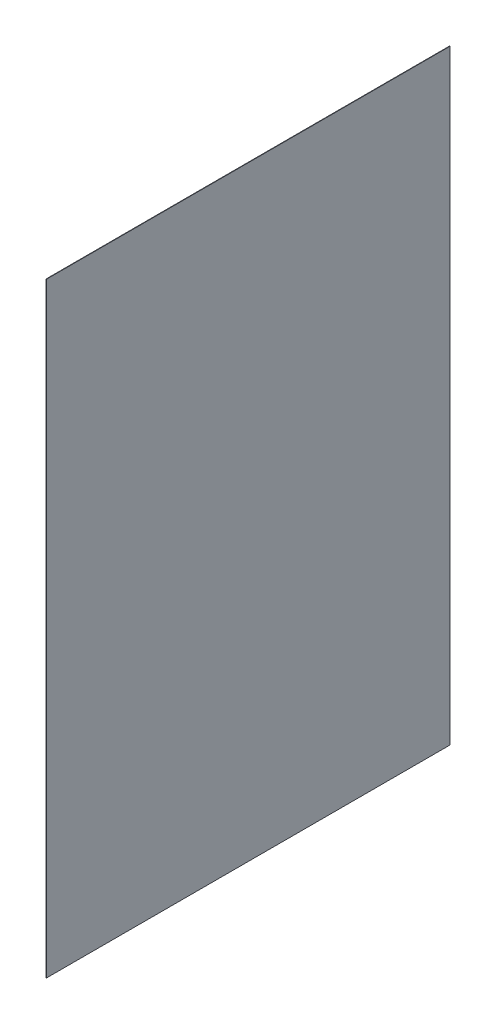
ISO-10303-21;
HEADER;
FILE_DESCRIPTION(('STEP AP214'),'2;1');
FILE_NAME('part.step','',(''),(''),'','','');
FILE_SCHEMA(('AUTOMOTIVE_DESIGN { 1 0 10303 214 1 1 1 1 }'));
ENDSEC;
DATA;
#1=APPLICATION_CONTEXT('core data for automotive mechanical design processes');
#2=APPLICATION_PROTOCOL_DEFINITION('international standard','automotive_design',2000,#1);
#3=PRODUCT_CONTEXT('',#1,'mechanical');
#4=PRODUCT('Part','Part','',(#3));
#5=PRODUCT_RELATED_PRODUCT_CATEGORY('part','',(#4));
#6=PRODUCT_DEFINITION_FORMATION('','',#4);
#7=PRODUCT_DEFINITION_CONTEXT('part definition',#1,'design');
#8=PRODUCT_DEFINITION('design','',#6,#7);
#9=PRODUCT_DEFINITION_SHAPE('','',#8);
#10=(LENGTH_UNIT() NAMED_UNIT(*) SI_UNIT(.MILLI.,.METRE.));
#11=(NAMED_UNIT(*) PLANE_ANGLE_UNIT() SI_UNIT($,.RADIAN.));
#12=(NAMED_UNIT(*) SI_UNIT($,.STERADIAN.) SOLID_ANGLE_UNIT());
#13=UNCERTAINTY_MEASURE_WITH_UNIT(LENGTH_MEASURE(1.E-05),#10,'distance_accuracy_value','');
#14=(GEOMETRIC_REPRESENTATION_CONTEXT(3) GLOBAL_UNCERTAINTY_ASSIGNED_CONTEXT((#13)) GLOBAL_UNIT_ASSIGNED_CONTEXT((#10,
#11,#12)) REPRESENTATION_CONTEXT('',''));
#15=CARTESIAN_POINT('',(0.,0.,0.));
#16=DIRECTION('',(0.,0.,1.));
#17=DIRECTION('',(1.,0.,0.));
#18=AXIS2_PLACEMENT_3D('',#15,#16,#17);
#19=CARTESIAN_POINT('',(-0.7,0.,0.));
#20=DIRECTION('',(0.,0.,1.));
#21=DIRECTION('',(1.,0.,0.));
#22=AXIS2_PLACEMENT_3D('',#19,#20,#21);
#23=PLANE('',#22);
#24=DIRECTION('',(0.,-1.,0.));
#25=VECTOR('',#24,1.);
#26=CARTESIAN_POINT('',(0.,0.,0.));
#27=LINE('',#26,#25);
#28=CARTESIAN_POINT('',(0.,988.4,0.));
#29=VERTEX_POINT('',#28);
#30=CARTESIAN_POINT('',(0.,0.,0.));
#31=VERTEX_POINT('',#30);
#32=EDGE_CURVE('E103',#29,#31,#27,.T.);
#33=ORIENTED_EDGE('',*,*,#32,.F.);
#34=DIRECTION('',(1.,0.,0.));
#35=VECTOR('',#34,1.);
#36=CARTESIAN_POINT('',(-0.7,988.4,0.));
#37=LINE('',#36,#35);
#38=CARTESIAN_POINT('',(-0.7,988.4,0.));
#39=VERTEX_POINT('',#38);
#40=EDGE_CURVE('E11',#39,#29,#37,.T.);
#41=ORIENTED_EDGE('',*,*,#40,.F.);
#42=DIRECTION('',(0.,-1.,0.));
#43=VECTOR('',#42,1.);
#44=CARTESIAN_POINT('',(-0.7,0.,0.));
#45=LINE('',#44,#43);
#46=CARTESIAN_POINT('',(-0.7,0.,0.));
#47=VERTEX_POINT('',#46);
#48=EDGE_CURVE('E97',#39,#47,#45,.T.);
#49=ORIENTED_EDGE('',*,*,#48,.T.);
#50=DIRECTION('',(1.,0.,0.));
#51=VECTOR('',#50,1.);
#52=CARTESIAN_POINT('',(-0.7,0.,0.));
#53=LINE('',#52,#51);
#54=EDGE_CURVE('E42',#47,#31,#53,.T.);
#55=ORIENTED_EDGE('',*,*,#54,.T.);
#56=EDGE_LOOP('',(#33,#41,#49,#55));
#57=FACE_BOUND('',#56,.T.);
#58=ADVANCED_FACE('F39',(#57),#23,.T.);
#59=CARTESIAN_POINT('',(-0.7,988.4,0.));
#60=DIRECTION('',(0.,1.,0.));
#61=DIRECTION('',(0.,0.,1.));
#62=AXIS2_PLACEMENT_3D('',#59,#60,#61);
#63=PLANE('',#62);
#64=DIRECTION('',(0.,0.,1.));
#65=VECTOR('',#64,1.);
#66=CARTESIAN_POINT('',(0.,988.4,0.));
#67=LINE('',#66,#65);
#68=CARTESIAN_POINT('',(0.,988.4,-659.));
#69=VERTEX_POINT('',#68);
#70=EDGE_CURVE('E99',#69,#29,#67,.T.);
#71=ORIENTED_EDGE('',*,*,#70,.F.);
#72=DIRECTION('',(1.,0.,0.));
#73=VECTOR('',#72,1.);
#74=CARTESIAN_POINT('',(-0.7,988.4,-659.));
#75=LINE('',#74,#73);
#76=CARTESIAN_POINT('',(-0.7,988.4,-659.));
#77=VERTEX_POINT('',#76);
#78=EDGE_CURVE('E48',#77,#69,#75,.T.);
#79=ORIENTED_EDGE('',*,*,#78,.F.);
#80=DIRECTION('',(0.,0.,1.));
#81=VECTOR('',#80,1.);
#82=CARTESIAN_POINT('',(-0.7,988.4,0.));
#83=LINE('',#82,#81);
#84=EDGE_CURVE('E94',#77,#39,#83,.T.);
#85=ORIENTED_EDGE('',*,*,#84,.T.);
#86=ORIENTED_EDGE('',*,*,#40,.T.);
#87=EDGE_LOOP('',(#71,#79,#85,#86));
#88=FACE_BOUND('',#87,.T.);
#89=ADVANCED_FACE('F113',(#88),#63,.T.);
#90=CARTESIAN_POINT('',(-0.7,0.,-659.));
#91=DIRECTION('',(0.,0.,-1.));
#92=DIRECTION('',(-1.,0.,0.));
#93=AXIS2_PLACEMENT_3D('',#90,#91,#92);
#94=PLANE('',#93);
#95=DIRECTION('',(0.,1.,0.));
#96=VECTOR('',#95,1.);
#97=CARTESIAN_POINT('',(0.,0.,-659.));
#98=LINE('',#97,#96);
#99=CARTESIAN_POINT('',(0.,0.,-659.));
#100=VERTEX_POINT('',#99);
#101=EDGE_CURVE('E89',#100,#69,#98,.T.);
#102=ORIENTED_EDGE('',*,*,#101,.F.);
#103=DIRECTION('',(1.,0.,0.));
#104=VECTOR('',#103,1.);
#105=CARTESIAN_POINT('',(-0.7,0.,-659.));
#106=LINE('',#105,#104);
#107=CARTESIAN_POINT('',(-0.7,0.,-659.));
#108=VERTEX_POINT('',#107);
#109=EDGE_CURVE('E84',#108,#100,#106,.T.);
#110=ORIENTED_EDGE('',*,*,#109,.F.);
#111=DIRECTION('',(0.,1.,0.));
#112=VECTOR('',#111,1.);
#113=CARTESIAN_POINT('',(-0.7,0.,-659.));
#114=LINE('',#113,#112);
#115=EDGE_CURVE('E87',#108,#77,#114,.T.);
#116=ORIENTED_EDGE('',*,*,#115,.T.);
#117=ORIENTED_EDGE('',*,*,#78,.T.);
#118=EDGE_LOOP('',(#102,#110,#116,#117));
#119=FACE_BOUND('',#118,.T.);
#120=ADVANCED_FACE('F86',(#119),#94,.T.);
#121=CARTESIAN_POINT('',(-0.7,0.,0.));
#122=DIRECTION('',(0.,-1.,0.));
#123=DIRECTION('',(0.,0.,-1.));
#124=AXIS2_PLACEMENT_3D('',#121,#122,#123);
#125=PLANE('',#124);
#126=DIRECTION('',(0.,0.,-1.));
#127=VECTOR('',#126,1.);
#128=CARTESIAN_POINT('',(0.,0.,0.));
#129=LINE('',#128,#127);
#130=EDGE_CURVE('E106',#31,#100,#129,.T.);
#131=ORIENTED_EDGE('',*,*,#130,.F.);
#132=ORIENTED_EDGE('',*,*,#54,.F.);
#133=DIRECTION('',(0.,0.,-1.));
#134=VECTOR('',#133,1.);
#135=CARTESIAN_POINT('',(-0.7,0.,0.));
#136=LINE('',#135,#134);
#137=EDGE_CURVE('E93',#47,#108,#136,.T.);
#138=ORIENTED_EDGE('',*,*,#137,.T.);
#139=ORIENTED_EDGE('',*,*,#109,.T.);
#140=EDGE_LOOP('',(#131,#132,#138,#139));
#141=FACE_BOUND('',#140,.T.);
#142=ADVANCED_FACE('F96',(#141),#125,.T.);
#143=CARTESIAN_POINT('',(-0.7,0.,0.));
#144=DIRECTION('',(-1.,0.,0.));
#145=DIRECTION('',(0.,0.,1.));
#146=AXIS2_PLACEMENT_3D('',#143,#144,#145);
#147=PLANE('',#146);
#148=ORIENTED_EDGE('',*,*,#48,.F.);
#149=ORIENTED_EDGE('',*,*,#84,.F.);
#150=ORIENTED_EDGE('',*,*,#115,.F.);
#151=ORIENTED_EDGE('',*,*,#137,.F.);
#152=EDGE_LOOP('',(#148,#149,#150,#151));
#153=FACE_BOUND('',#152,.T.);
#154=ADVANCED_FACE('F92',(#153),#147,.T.);
#155=CARTESIAN_POINT('',(0.,0.,0.));
#156=DIRECTION('',(-1.,0.,0.));
#157=DIRECTION('',(0.,0.,1.));
#158=AXIS2_PLACEMENT_3D('',#155,#156,#157);
#159=PLANE('',#158);
#160=ORIENTED_EDGE('',*,*,#32,.T.);
#161=ORIENTED_EDGE('',*,*,#130,.T.);
#162=ORIENTED_EDGE('',*,*,#101,.T.);
#163=ORIENTED_EDGE('',*,*,#70,.T.);
#164=EDGE_LOOP('',(#160,#161,#162,#163));
#165=FACE_BOUND('',#164,.T.);
#166=ADVANCED_FACE('F112',(#165),#159,.F.);
#167=CLOSED_SHELL('',(#58,#89,#120,#142,#154,#166));
#168=MANIFOLD_SOLID_BREP('B2',#167);
#169=ADVANCED_BREP_SHAPE_REPRESENTATION('',(#18,#168),#14);
#170=SHAPE_DEFINITION_REPRESENTATION(#9,#169);
ENDSEC;
END-ISO-10303-21;
